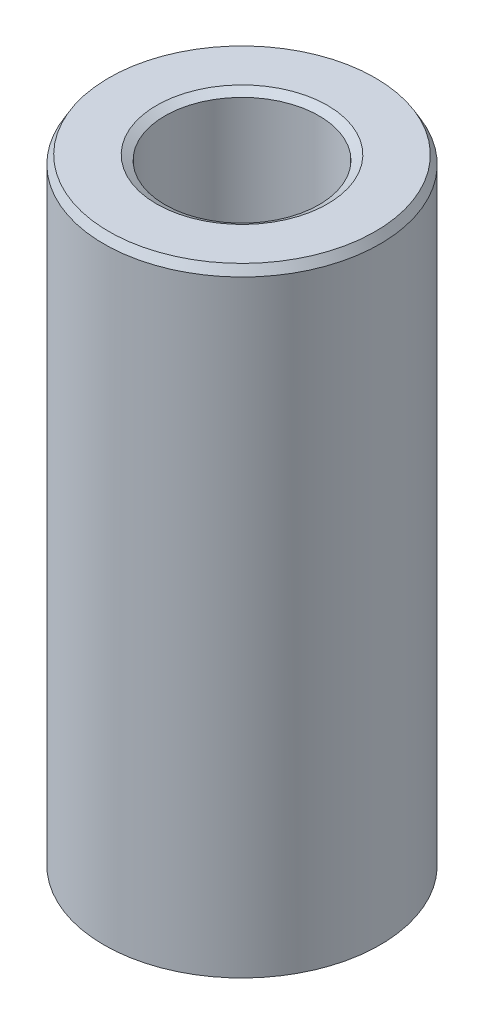
ISO-10303-21;
HEADER;
FILE_DESCRIPTION(('STEP AP214'),'2;1');
FILE_NAME('part.step','',(''),(''),'','','');
FILE_SCHEMA(('AUTOMOTIVE_DESIGN { 1 0 10303 214 1 1 1 1 }'));
ENDSEC;
DATA;
#1=APPLICATION_CONTEXT('core data for automotive mechanical design processes');
#2=APPLICATION_PROTOCOL_DEFINITION('international standard','automotive_design',2000,#1);
#3=PRODUCT_CONTEXT('',#1,'mechanical');
#4=PRODUCT('Part','Part','',(#3));
#5=PRODUCT_RELATED_PRODUCT_CATEGORY('part','',(#4));
#6=PRODUCT_DEFINITION_FORMATION('','',#4);
#7=PRODUCT_DEFINITION_CONTEXT('part definition',#1,'design');
#8=PRODUCT_DEFINITION('design','',#6,#7);
#9=PRODUCT_DEFINITION_SHAPE('','',#8);
#10=(LENGTH_UNIT() NAMED_UNIT(*) SI_UNIT(.MILLI.,.METRE.));
#11=(NAMED_UNIT(*) PLANE_ANGLE_UNIT() SI_UNIT($,.RADIAN.));
#12=(NAMED_UNIT(*) SI_UNIT($,.STERADIAN.) SOLID_ANGLE_UNIT());
#13=UNCERTAINTY_MEASURE_WITH_UNIT(LENGTH_MEASURE(1.E-05),#10,'distance_accuracy_value','');
#14=(GEOMETRIC_REPRESENTATION_CONTEXT(3) GLOBAL_UNCERTAINTY_ASSIGNED_CONTEXT((#13)) GLOBAL_UNIT_ASSIGNED_CONTEXT((#10,
#11,#12)) REPRESENTATION_CONTEXT('',''));
#15=CARTESIAN_POINT('',(0.,0.,0.));
#16=DIRECTION('',(0.,0.,1.));
#17=DIRECTION('',(1.,0.,0.));
#18=AXIS2_PLACEMENT_3D('',#15,#16,#17);
#19=CARTESIAN_POINT('',(0.,235.937378205607,0.));
#20=DIRECTION('',(0.,-1.,0.));
#21=DIRECTION('',(0.,0.,-1.));
#22=AXIS2_PLACEMENT_3D('',#19,#20,#21);
#23=CYLINDRICAL_SURFACE('',#22,52.5);
#24=CARTESIAN_POINT('',(0.,1.84329486663562,0.));
#25=DIRECTION('',(0.,1.,0.));
#26=DIRECTION('',(0.,0.,1.));
#27=AXIS2_PLACEMENT_3D('',#24,#25,#26);
#28=CIRCLE('',#27,52.5);
#29=CARTESIAN_POINT('',(0.,1.84329486663562,-52.5));
#30=VERTEX_POINT('',#29);
#31=EDGE_CURVE('E10',#30,#30,#28,.T.);
#32=CARTESIAN_POINT('',(0.,232.744697843263,0.));
#33=DIRECTION('',(0.,1.,0.));
#34=DIRECTION('',(0.,0.,1.));
#35=AXIS2_PLACEMENT_3D('',#32,#33,#34);
#36=CIRCLE('',#35,52.5);
#37=CARTESIAN_POINT('',(0.,232.744697843263,-52.5));
#38=VERTEX_POINT('',#37);
#39=EDGE_CURVE('E50',#38,#38,#36,.F.);
#40=CARTESIAN_POINT('',(0.,1.84329486663562,-52.5));
#41=CARTESIAN_POINT('',(0.,4.24851781430882,-52.5));
#42=CARTESIAN_POINT('',(0.,6.65374076198202,-52.5));
#43=CARTESIAN_POINT('',(0.,11.4641866573284,-52.5));
#44=CARTESIAN_POINT('',(0.,13.8694096050016,-52.5));
#45=CARTESIAN_POINT('',(0.,18.679855500348,-52.5));
#46=CARTESIAN_POINT('',(0.,21.0850784480212,-52.5));
#47=CARTESIAN_POINT('',(0.,25.8955243433676,-52.5));
#48=CARTESIAN_POINT('',(0.,28.3007472910408,-52.5));
#49=CARTESIAN_POINT('',(0.,33.1111931863872,-52.5));
#50=CARTESIAN_POINT('',(0.,35.5164161340604,-52.5));
#51=CARTESIAN_POINT('',(0.,40.3268620294068,-52.5));
#52=CARTESIAN_POINT('',(0.,42.73208497708,-52.5));
#53=CARTESIAN_POINT('',(0.,47.5425308724264,-52.5));
#54=CARTESIAN_POINT('',(0.,49.9477538200996,-52.5));
#55=CARTESIAN_POINT('',(0.,54.758199715446,-52.5));
#56=CARTESIAN_POINT('',(0.,57.1634226631192,-52.5));
#57=CARTESIAN_POINT('',(0.,61.9738685584657,-52.5));
#58=CARTESIAN_POINT('',(0.,64.3790915061388,-52.5));
#59=CARTESIAN_POINT('',(0.,69.1895374014853,-52.5));
#60=CARTESIAN_POINT('',(0.,71.5947603491585,-52.5));
#61=CARTESIAN_POINT('',(0.,76.4052062445049,-52.5));
#62=CARTESIAN_POINT('',(0.,78.810429192178,-52.5));
#63=CARTESIAN_POINT('',(0.,83.6208750875244,-52.5));
#64=CARTESIAN_POINT('',(0.,86.0260980351976,-52.5));
#65=CARTESIAN_POINT('',(0.,90.8365439305441,-52.5));
#66=CARTESIAN_POINT('',(0.,93.2417668782172,-52.5));
#67=CARTESIAN_POINT('',(0.,98.0522127735637,-52.5));
#68=CARTESIAN_POINT('',(0.,100.457435721237,-52.5));
#69=CARTESIAN_POINT('',(0.,105.267881616583,-52.5));
#70=CARTESIAN_POINT('',(0.,107.673104564256,-52.5));
#71=CARTESIAN_POINT('',(0.,112.483550459603,-52.5));
#72=CARTESIAN_POINT('',(0.,114.888773407276,-52.5));
#73=CARTESIAN_POINT('',(0.,119.699219302622,-52.5));
#74=CARTESIAN_POINT('',(0.,122.104442250296,-52.5));
#75=CARTESIAN_POINT('',(0.,126.914888145642,-52.5));
#76=CARTESIAN_POINT('',(0.,129.320111093315,-52.5));
#77=CARTESIAN_POINT('',(0.,134.130556988662,-52.5));
#78=CARTESIAN_POINT('',(0.,136.535779936335,-52.5));
#79=CARTESIAN_POINT('',(0.,141.346225831681,-52.5));
#80=CARTESIAN_POINT('',(0.,143.751448779354,-52.5));
#81=CARTESIAN_POINT('',(0.,148.561894674701,-52.5));
#82=CARTESIAN_POINT('',(0.,150.967117622374,-52.5));
#83=CARTESIAN_POINT('',(0.,155.77756351772,-52.5));
#84=CARTESIAN_POINT('',(0.,158.182786465394,-52.5));
#85=CARTESIAN_POINT('',(0.,162.99323236074,-52.5));
#86=CARTESIAN_POINT('',(0.,165.398455308413,-52.5));
#87=CARTESIAN_POINT('',(0.,170.20890120376,-52.5));
#88=CARTESIAN_POINT('',(0.,172.614124151433,-52.5));
#89=CARTESIAN_POINT('',(0.,177.424570046779,-52.5));
#90=CARTESIAN_POINT('',(0.,179.829792994453,-52.5));
#91=CARTESIAN_POINT('',(0.,184.640238889799,-52.5));
#92=CARTESIAN_POINT('',(0.,187.045461837472,-52.5));
#93=CARTESIAN_POINT('',(0.,191.855907732819,-52.5));
#94=CARTESIAN_POINT('',(0.,194.261130680492,-52.5));
#95=CARTESIAN_POINT('',(0.,199.071576575838,-52.5));
#96=CARTESIAN_POINT('',(0.,201.476799523511,-52.5));
#97=CARTESIAN_POINT('',(0.,206.287245418858,-52.5));
#98=CARTESIAN_POINT('',(0.,208.692468366531,-52.5));
#99=CARTESIAN_POINT('',(0.,213.502914261877,-52.5));
#100=CARTESIAN_POINT('',(0.,215.908137209551,-52.5));
#101=CARTESIAN_POINT('',(0.,220.718583104897,-52.5));
#102=CARTESIAN_POINT('',(0.,223.12380605257,-52.5));
#103=CARTESIAN_POINT('',(0.,227.934251947917,-52.5));
#104=CARTESIAN_POINT('',(0.,230.33947489559,-52.5));
#105=CARTESIAN_POINT('',(0.,232.744697843263,-52.5));
#106=B_SPLINE_CURVE_WITH_KNOTS('',3,(#40,#41,#42,#43,#44,#45,#46,#47,#48,#49,#50,#51,#52,#53,
#54,#55,#56,#57,#58,#59,#60,#61,#62,#63,#64,#65,#66,#67,#68,#69,#70,#71,#72,#73,#74,#75,#76,#77,
#78,#79,#80,#81,#82,#83,#84,#85,#86,#87,#88,#89,#90,#91,#92,#93,#94,#95,#96,#97,#98,#99,#100,
#101,#102,#103,#104,#105),.UNSPECIFIED.,.F.,.F.,(4,2,2,2,2,2,2,2,2,2,2,2,2,2,2,2,2,2,2,2,2,2,2,
2,2,2,2,2,2,2,2,2,4),(0.,7.21566884301961,14.4313376860392,21.6470065290588,28.8626753720784,
36.078344215098,43.2940130581176,50.5096819011372,57.7253507441568,64.9410195871764,
72.156688430196,79.3723572732156,86.5880261162352,93.8036949592548,101.019363802274,
108.235032645294,115.450701488314,122.666370331333,129.882039174353,137.097708017372,
144.313376860392,151.529045703412,158.744714546431,165.960383389451,173.17605223247,
180.39172107549,187.60738991851,194.823058761529,202.038727604549,209.254396447568,
216.470065290588,223.685734133608,230.901402976627),.UNSPECIFIED.);
#107=EDGE_CURVE('BSEAM39',#30,#38,#106,.T.);
#108=ORIENTED_EDGE('',*,*,#31,.T.);
#109=ORIENTED_EDGE('',*,*,#39,.T.);
#110=ORIENTED_EDGE('',*,*,#107,.T.);
#111=ORIENTED_EDGE('',*,*,#107,.F.);
#112=EDGE_LOOP('',(#108,#110,#109,#111));
#113=FACE_BOUND('',#112,.T.);
#114=ADVANCED_FACE('F39',(#113),#23,.T.);
#115=CARTESIAN_POINT('',(0.,235.937378205607,0.));
#116=DIRECTION('',(0.,1.,0.));
#117=DIRECTION('',(0.,0.,1.));
#118=AXIS2_PLACEMENT_3D('',#115,#116,#117);
#119=PLANE('',#118);
#120=CARTESIAN_POINT('',(0.,235.937378205607,0.));
#121=DIRECTION('',(0.,1.,0.));
#122=DIRECTION('',(0.,0.,1.));
#123=AXIS2_PLACEMENT_3D('',#120,#121,#122);
#124=CIRCLE('',#123,32.5056121970505);
#125=CARTESIAN_POINT('',(0.,235.937378205607,32.5056121970505));
#126=VERTEX_POINT('',#125);
#127=EDGE_CURVE('E58',#126,#126,#124,.F.);
#128=ORIENTED_EDGE('',*,*,#127,.T.);
#129=EDGE_LOOP('',(#128));
#130=FACE_BOUND('',#129,.T.);
#131=CARTESIAN_POINT('',(0.,235.937378205607,0.));
#132=DIRECTION('',(0.,1.,0.));
#133=DIRECTION('',(0.,0.,1.));
#134=AXIS2_PLACEMENT_3D('',#131,#132,#133);
#135=CIRCLE('',#134,50.6567051333644);
#136=CARTESIAN_POINT('',(0.,235.937378205607,-50.6567051333644));
#137=VERTEX_POINT('',#136);
#138=EDGE_CURVE('E61',#137,#137,#135,.T.);
#139=ORIENTED_EDGE('',*,*,#138,.T.);
#140=EDGE_LOOP('',(#139));
#141=FACE_BOUND('',#140,.T.);
#142=ADVANCED_FACE('F88',(#130,#141),#119,.T.);
#143=CARTESIAN_POINT('',(0.,0.,0.));
#144=DIRECTION('',(0.,1.,0.));
#145=DIRECTION('',(0.,0.,1.));
#146=AXIS2_PLACEMENT_3D('',#143,#144,#145);
#147=PLANE('',#146);
#148=CARTESIAN_POINT('',(0.,0.,0.));
#149=DIRECTION('',(0.,1.,0.));
#150=DIRECTION('',(0.,0.,1.));
#151=AXIS2_PLACEMENT_3D('',#148,#149,#150);
#152=CIRCLE('',#151,31.1562267013423);
#153=CARTESIAN_POINT('',(0.,0.,31.1562267013423));
#154=VERTEX_POINT('',#153);
#155=EDGE_CURVE('E51',#154,#154,#152,.T.);
#156=ORIENTED_EDGE('',*,*,#155,.T.);
#157=EDGE_LOOP('',(#156));
#158=FACE_BOUND('',#157,.T.);
#159=CARTESIAN_POINT('',(0.,0.,0.));
#160=DIRECTION('',(0.,1.,0.));
#161=DIRECTION('',(0.,0.,1.));
#162=AXIS2_PLACEMENT_3D('',#159,#160,#161);
#163=CIRCLE('',#162,49.3073196376562);
#164=CARTESIAN_POINT('',(0.,0.,49.3073196376562));
#165=VERTEX_POINT('',#164);
#166=EDGE_CURVE('E54',#165,#165,#163,.F.);
#167=ORIENTED_EDGE('',*,*,#166,.T.);
#168=EDGE_LOOP('',(#167));
#169=FACE_BOUND('',#168,.T.);
#170=ADVANCED_FACE('F83',(#158,#169),#147,.F.);
#171=CARTESIAN_POINT('',(0.,235.937378205607,0.));
#172=DIRECTION('',(0.,-1.,0.));
#173=DIRECTION('',(0.,0.,-1.));
#174=AXIS2_PLACEMENT_3D('',#171,#172,#173);
#175=CYLINDRICAL_SURFACE('',#174,29.3129318347067);
#176=CARTESIAN_POINT('',(0.,234.094083338971,0.));
#177=DIRECTION('',(0.,1.,0.));
#178=DIRECTION('',(0.,0.,1.));
#179=AXIS2_PLACEMENT_3D('',#176,#177,#178);
#180=CIRCLE('',#179,29.3129318347067);
#181=CARTESIAN_POINT('',(0.,234.094083338971,29.3129318347067));
#182=VERTEX_POINT('',#181);
#183=EDGE_CURVE('E67',#182,#182,#180,.T.);
#184=ORIENTED_EDGE('',*,*,#183,.T.);
#185=EDGE_LOOP('',(#184));
#186=FACE_BOUND('',#185,.T.);
#187=CARTESIAN_POINT('',(0.,3.19268036234374,0.));
#188=DIRECTION('',(0.,1.,0.));
#189=DIRECTION('',(0.,0.,1.));
#190=AXIS2_PLACEMENT_3D('',#187,#188,#189);
#191=CIRCLE('',#190,29.3129318347067);
#192=CARTESIAN_POINT('',(0.,3.19268036234374,29.3129318347067));
#193=VERTEX_POINT('',#192);
#194=EDGE_CURVE('E69',#193,#193,#191,.F.);
#195=ORIENTED_EDGE('',*,*,#194,.T.);
#196=EDGE_LOOP('',(#195));
#197=FACE_BOUND('',#196,.T.);
#198=ADVANCED_FACE('F71',(#186,#197),#175,.F.);
#199=CARTESIAN_POINT('',(0.,234.094083338971,0.));
#200=DIRECTION('',(0.,1.,0.));
#201=DIRECTION('',(0.,0.,1.));
#202=AXIS2_PLACEMENT_3D('',#199,#200,#201);
#203=CONICAL_SURFACE('',#202,29.3129318347067,1.0471975511966);
#204=CARTESIAN_POINT('',(0.,235.937378205607,32.5056121970505));
#205=CARTESIAN_POINT('',(0.,235.918177217413,32.4723551099428));
#206=CARTESIAN_POINT('',(0.,235.898976229218,32.439098022835));
#207=CARTESIAN_POINT('',(0.,235.86057425283,32.3725838486195));
#208=CARTESIAN_POINT('',(0.,235.841373264636,32.3393267615118));
#209=CARTESIAN_POINT('',(0.,235.802971288248,32.2728125872963));
#210=CARTESIAN_POINT('',(0.,235.783770300054,32.2395555001885));
#211=CARTESIAN_POINT('',(0.,235.745368323665,32.173041325973));
#212=CARTESIAN_POINT('',(0.,235.726167335471,32.1397842388653));
#213=CARTESIAN_POINT('',(0.,235.687765359083,32.0732700646498));
#214=CARTESIAN_POINT('',(0.,235.668564370889,32.040012977542));
#215=CARTESIAN_POINT('',(0.,235.630162394501,31.9734988033265));
#216=CARTESIAN_POINT('',(0.,235.610961406307,31.9402417162188));
#217=CARTESIAN_POINT('',(0.,235.572559429918,31.8737275420033));
#218=CARTESIAN_POINT('',(0.,235.553358441724,31.8404704548955));
#219=CARTESIAN_POINT('',(0.,235.514956465336,31.77395628068));
#220=CARTESIAN_POINT('',(0.,235.495755477142,31.7406991935723));
#221=CARTESIAN_POINT('',(0.,235.457353500754,31.6741850193568));
#222=CARTESIAN_POINT('',(0.,235.438152512559,31.6409279322491));
#223=CARTESIAN_POINT('',(0.,235.399750536171,31.5744137580336));
#224=CARTESIAN_POINT('',(0.,235.380549547977,31.5411566709258));
#225=CARTESIAN_POINT('',(0.,235.342147571589,31.4746424967103));
#226=CARTESIAN_POINT('',(0.,235.322946583395,31.4413854096026));
#227=CARTESIAN_POINT('',(0.,235.284544607007,31.3748712353871));
#228=CARTESIAN_POINT('',(0.,235.265343618812,31.3416141482793));
#229=CARTESIAN_POINT('',(0.,235.226941642424,31.2750999740638));
#230=CARTESIAN_POINT('',(0.,235.20774065423,31.2418428869561));
#231=CARTESIAN_POINT('',(0.,235.169338677842,31.1753287127406));
#232=CARTESIAN_POINT('',(0.,235.150137689648,31.1420716256328));
#233=CARTESIAN_POINT('',(0.,235.111735713259,31.0755574514173));
#234=CARTESIAN_POINT('',(0.,235.092534725065,31.0423003643096));
#235=CARTESIAN_POINT('',(0.,235.054132748677,30.9757861900941));
#236=CARTESIAN_POINT('',(0.,235.034931760483,30.9425291029863));
#237=CARTESIAN_POINT('',(0.,234.996529784095,30.8760149287709));
#238=CARTESIAN_POINT('',(0.,234.977328795901,30.8427578416631));
#239=CARTESIAN_POINT('',(0.,234.938926819512,30.7762436674476));
#240=CARTESIAN_POINT('',(0.,234.919725831318,30.7429865803399));
#241=CARTESIAN_POINT('',(0.,234.88132385493,30.6764724061244));
#242=CARTESIAN_POINT('',(0.,234.862122866736,30.6432153190166));
#243=CARTESIAN_POINT('',(0.,234.823720890348,30.5767011448011));
#244=CARTESIAN_POINT('',(0.,234.804519902153,30.5434440576934));
#245=CARTESIAN_POINT('',(0.,234.766117925765,30.4769298834779));
#246=CARTESIAN_POINT('',(0.,234.746916937571,30.4436727963701));
#247=CARTESIAN_POINT('',(0.,234.708514961183,30.3771586221546));
#248=CARTESIAN_POINT('',(0.,234.689313972989,30.3439015350469));
#249=CARTESIAN_POINT('',(0.,234.650911996601,30.2773873608314));
#250=CARTESIAN_POINT('',(0.,234.631711008406,30.2441302737236));
#251=CARTESIAN_POINT('',(0.,234.593309032018,30.1776160995081));
#252=CARTESIAN_POINT('',(0.,234.574108043824,30.1443590124004));
#253=CARTESIAN_POINT('',(0.,234.535706067436,30.0778448381849));
#254=CARTESIAN_POINT('',(0.,234.516505079242,30.0445877510771));
#255=CARTESIAN_POINT('',(0.,234.478103102853,29.9780735768617));
#256=CARTESIAN_POINT('',(0.,234.458902114659,29.9448164897539));
#257=CARTESIAN_POINT('',(0.,234.420500138271,29.8783023155384));
#258=CARTESIAN_POINT('',(0.,234.401299150077,29.8450452284307));
#259=CARTESIAN_POINT('',(0.,234.362897173689,29.7785310542152));
#260=CARTESIAN_POINT('',(0.,234.343696185495,29.7452739671074));
#261=CARTESIAN_POINT('',(0.,234.305294209106,29.6787597928919));
#262=CARTESIAN_POINT('',(0.,234.286093220912,29.6455027057842));
#263=CARTESIAN_POINT('',(0.,234.247691244524,29.5789885315687));
#264=CARTESIAN_POINT('',(0.,234.22849025633,29.5457314444609));
#265=CARTESIAN_POINT('',(0.,234.190088279942,29.4792172702454));
#266=CARTESIAN_POINT('',(0.,234.170887291748,29.4459601831377));
#267=CARTESIAN_POINT('',(0.,234.132485315359,29.3794460089222));
#268=CARTESIAN_POINT('',(0.,234.113284327165,29.3461889218144));
#269=CARTESIAN_POINT('',(0.,234.094083338971,29.3129318347067));
#270=B_SPLINE_CURVE_WITH_KNOTS('',3,(#204,#205,#206,#207,#208,#209,#210,#211,#212,#213,#214,
#215,#216,#217,#218,#219,#220,#221,#222,#223,#224,#225,#226,#227,#228,#229,#230,#231,#232,#233,
#234,#235,#236,#237,#238,#239,#240,#241,#242,#243,#244,#245,#246,#247,#248,#249,#250,#251,#252,
#253,#254,#255,#256,#257,#258,#259,#260,#261,#262,#263,#264,#265,#266,#267,#268,#269),
.UNSPECIFIED.,.F.,.F.,(4,2,2,2,2,2,2,2,2,2,2,2,2,2,2,2,2,2,2,2,2,2,2,2,2,2,2,2,2,2,2,2,4),(0.,
0.115205929164735,0.23041185832947,0.345617787494192,0.460823716658921,0.576029645823642,
0.691235574988377,0.806441504153092,0.921647433317828,1.03685336248255,1.15205929164728,
1.267265220812,1.38247114997673,1.49767707914146,1.61288300830619,1.72808893747091,
1.84329486663564,1.95850079580038,2.07370672496509,2.18891265412983,2.30411858329455,
2.41932451245928,2.534530441624,2.64973637078874,2.76494229995346,2.88014822911819,
2.99535415828291,3.11056008744765,3.22576601661236,3.3409719457771,3.45617787494182,
3.57138380410655,3.68658973327127),.UNSPECIFIED.);
#271=EDGE_CURVE('BSEAM77',#126,#182,#270,.T.);
#272=ORIENTED_EDGE('',*,*,#127,.F.);
#273=ORIENTED_EDGE('',*,*,#183,.F.);
#274=ORIENTED_EDGE('',*,*,#271,.T.);
#275=ORIENTED_EDGE('',*,*,#271,.F.);
#276=EDGE_LOOP('',(#272,#274,#273,#275));
#277=FACE_BOUND('',#276,.T.);
#278=ADVANCED_FACE('F77',(#277),#203,.F.);
#279=CARTESIAN_POINT('',(0.,0.,0.));
#280=DIRECTION('',(0.,-1.,0.));
#281=DIRECTION('',(0.,0.,-1.));
#282=AXIS2_PLACEMENT_3D('',#279,#280,#281);
#283=CONICAL_SURFACE('',#282,31.1562267013423,0.523598775598301);
#284=ORIENTED_EDGE('',*,*,#194,.F.);
#285=EDGE_LOOP('',(#284));
#286=FACE_BOUND('',#285,.T.);
#287=ORIENTED_EDGE('',*,*,#155,.F.);
#288=EDGE_LOOP('',(#287));
#289=FACE_BOUND('',#288,.T.);
#290=ADVANCED_FACE('F73',(#286,#289),#283,.F.);
#291=CARTESIAN_POINT('',(0.,1.84329486663562,0.));
#292=DIRECTION('',(0.,1.,0.));
#293=DIRECTION('',(0.,0.,1.));
#294=AXIS2_PLACEMENT_3D('',#291,#292,#293);
#295=CONICAL_SURFACE('',#294,52.5,1.0471975511966);
#296=ORIENTED_EDGE('',*,*,#166,.F.);
#297=EDGE_LOOP('',(#296));
#298=FACE_BOUND('',#297,.T.);
#299=ORIENTED_EDGE('',*,*,#31,.F.);
#300=EDGE_LOOP('',(#299));
#301=FACE_BOUND('',#300,.T.);
#302=ADVANCED_FACE('F76',(#298,#301),#295,.T.);
#303=CARTESIAN_POINT('',(0.,235.937378205607,0.));
#304=DIRECTION('',(0.,-1.,0.));
#305=DIRECTION('',(0.,0.,-1.));
#306=AXIS2_PLACEMENT_3D('',#303,#304,#305);
#307=CONICAL_SURFACE('',#306,50.6567051333644,0.523598775598298);
#308=CARTESIAN_POINT('',(0.,232.744697843263,-52.5));
#309=CARTESIAN_POINT('',(0.,232.777954930371,-52.4807990118059));
#310=CARTESIAN_POINT('',(0.,232.811212017478,-52.4615980236118));
#311=CARTESIAN_POINT('',(0.,232.877726191694,-52.4231960472235));
#312=CARTESIAN_POINT('',(0.,232.910983278802,-52.4039950590294));
#313=CARTESIAN_POINT('',(0.,232.977497453017,-52.3655930826412));
#314=CARTESIAN_POINT('',(0.,233.010754540125,-52.346392094447));
#315=CARTESIAN_POINT('',(0.,233.07726871434,-52.3079901180588));
#316=CARTESIAN_POINT('',(0.,233.110525801448,-52.2887891298647));
#317=CARTESIAN_POINT('',(0.,233.177039975664,-52.2503871534764));
#318=CARTESIAN_POINT('',(0.,233.210297062771,-52.2311861652823));
#319=CARTESIAN_POINT('',(0.,233.276811236987,-52.1927841888941));
#320=CARTESIAN_POINT('',(0.,233.310068324095,-52.1735832007));
#321=CARTESIAN_POINT('',(0.,233.37658249831,-52.1351812243117));
#322=CARTESIAN_POINT('',(0.,233.409839585418,-52.1159802361176));
#323=CARTESIAN_POINT('',(0.,233.476353759633,-52.0775782597294));
#324=CARTESIAN_POINT('',(0.,233.509610846741,-52.0583772715352));
#325=CARTESIAN_POINT('',(0.,233.576125020957,-52.019975295147));
#326=CARTESIAN_POINT('',(0.,233.609382108064,-52.0007743069529));
#327=CARTESIAN_POINT('',(0.,233.67589628228,-51.9623723305646));
#328=CARTESIAN_POINT('',(0.,233.709153369388,-51.9431713423705));
#329=CARTESIAN_POINT('',(0.,233.775667543603,-51.9047693659823));
#330=CARTESIAN_POINT('',(0.,233.808924630711,-51.8855683777881));
#331=CARTESIAN_POINT('',(0.,233.875438804926,-51.8471664013999));
#332=CARTESIAN_POINT('',(0.,233.908695892034,-51.8279654132058));
#333=CARTESIAN_POINT('',(0.,233.97521006625,-51.7895634368175));
#334=CARTESIAN_POINT('',(0.,234.008467153357,-51.7703624486234));
#335=CARTESIAN_POINT('',(0.,234.074981327573,-51.7319604722352));
#336=CARTESIAN_POINT('',(0.,234.108238414681,-51.7127594840411));
#337=CARTESIAN_POINT('',(0.,234.174752588896,-51.6743575076528));
#338=CARTESIAN_POINT('',(0.,234.208009676004,-51.6551565194587));
#339=CARTESIAN_POINT('',(0.,234.274523850219,-51.6167545430705));
#340=CARTESIAN_POINT('',(0.,234.307780937327,-51.5975535548763));
#341=CARTESIAN_POINT('',(0.,234.374295111543,-51.5591515784881));
#342=CARTESIAN_POINT('',(0.,234.40755219865,-51.539950590294));
#343=CARTESIAN_POINT('',(0.,234.474066372866,-51.5015486139057));
#344=CARTESIAN_POINT('',(0.,234.507323459974,-51.4823476257116));
#345=CARTESIAN_POINT('',(0.,234.573837634189,-51.4439456493234));
#346=CARTESIAN_POINT('',(0.,234.607094721297,-51.4247446611293));
#347=CARTESIAN_POINT('',(0.,234.673608895512,-51.386342684741));
#348=CARTESIAN_POINT('',(0.,234.70686598262,-51.3671416965469));
#349=CARTESIAN_POINT('',(0.,234.773380156835,-51.3287397201587));
#350=CARTESIAN_POINT('',(0.,234.806637243943,-51.3095387319645));
#351=CARTESIAN_POINT('',(0.,234.873151418159,-51.2711367555763));
#352=CARTESIAN_POINT('',(0.,234.906408505266,-51.2519357673822));
#353=CARTESIAN_POINT('',(0.,234.972922679482,-51.2135337909939));
#354=CARTESIAN_POINT('',(0.,235.00617976659,-51.1943328027998));
#355=CARTESIAN_POINT('',(0.,235.072693940805,-51.1559308264116));
#356=CARTESIAN_POINT('',(0.,235.105951027913,-51.1367298382174));
#357=CARTESIAN_POINT('',(0.,235.172465202128,-51.0983278618292));
#358=CARTESIAN_POINT('',(0.,235.205722289236,-51.0791268736351));
#359=CARTESIAN_POINT('',(0.,235.272236463452,-51.0407248972468));
#360=CARTESIAN_POINT('',(0.,235.305493550559,-51.0215239090527));
#361=CARTESIAN_POINT('',(0.,235.372007724775,-50.9831219326645));
#362=CARTESIAN_POINT('',(0.,235.405264811883,-50.9639209444704));
#363=CARTESIAN_POINT('',(0.,235.471778986098,-50.9255189680821));
#364=CARTESIAN_POINT('',(0.,235.505036073206,-50.906317979888));
#365=CARTESIAN_POINT('',(0.,235.571550247421,-50.8679160034998));
#366=CARTESIAN_POINT('',(0.,235.604807334529,-50.8487150153056));
#367=CARTESIAN_POINT('',(0.,235.671321508745,-50.8103130389174));
#368=CARTESIAN_POINT('',(0.,235.704578595852,-50.7911120507233));
#369=CARTESIAN_POINT('',(0.,235.771092770068,-50.752710074335));
#370=CARTESIAN_POINT('',(0.,235.804349857176,-50.7335090861409));
#371=CARTESIAN_POINT('',(0.,235.870864031391,-50.6951071097527));
#372=CARTESIAN_POINT('',(0.,235.904121118499,-50.6759061215585));
#373=CARTESIAN_POINT('',(0.,235.937378205607,-50.6567051333644));
#374=B_SPLINE_CURVE_WITH_KNOTS('',3,(#308,#309,#310,#311,#312,#313,#314,#315,#316,#317,#318,
#319,#320,#321,#322,#323,#324,#325,#326,#327,#328,#329,#330,#331,#332,#333,#334,#335,#336,#337,
#338,#339,#340,#341,#342,#343,#344,#345,#346,#347,#348,#349,#350,#351,#352,#353,#354,#355,#356,
#357,#358,#359,#360,#361,#362,#363,#364,#365,#366,#367,#368,#369,#370,#371,#372,#373),
.UNSPECIFIED.,.F.,.F.,(4,2,2,2,2,2,2,2,2,2,2,2,2,2,2,2,2,2,2,2,2,2,2,2,2,2,2,2,2,2,2,2,4),(0.,
0.115205929164722,0.230411858329444,0.345617787494167,0.460823716658885,0.576029645823607,
0.69123557498833,0.806441504153052,0.921647433317774,1.0368533624825,1.15205929164722,
1.26726522081194,1.38247114997666,1.49767707914138,1.61288300830611,1.72808893747083,
1.84329486663557,1.95850079580029,2.07370672496502,2.18891265412974,2.30411858329446,
2.41932451245918,2.53453044162391,2.64973637078863,2.76494229995335,2.88014822911807,
2.99535415828279,3.11056008744751,3.22576601661224,3.34097194577696,3.45617787494168,
3.5713838041064,3.68658973327115),.UNSPECIFIED.);
#375=EDGE_CURVE('BSEAM45',#38,#137,#374,.T.);
#376=ORIENTED_EDGE('',*,*,#39,.F.);
#377=ORIENTED_EDGE('',*,*,#138,.F.);
#378=ORIENTED_EDGE('',*,*,#375,.T.);
#379=ORIENTED_EDGE('',*,*,#375,.F.);
#380=EDGE_LOOP('',(#376,#378,#377,#379));
#381=FACE_BOUND('',#380,.T.);
#382=ADVANCED_FACE('F45',(#381),#307,.T.);
#383=CLOSED_SHELL('',(#114,#142,#170,#198,#278,#290,#302,#382));
#384=MANIFOLD_SOLID_BREP('B2',#383);
#385=ADVANCED_BREP_SHAPE_REPRESENTATION('',(#18,#384),#14);
#386=SHAPE_DEFINITION_REPRESENTATION(#9,#385);
ENDSEC;
END-ISO-10303-21;
